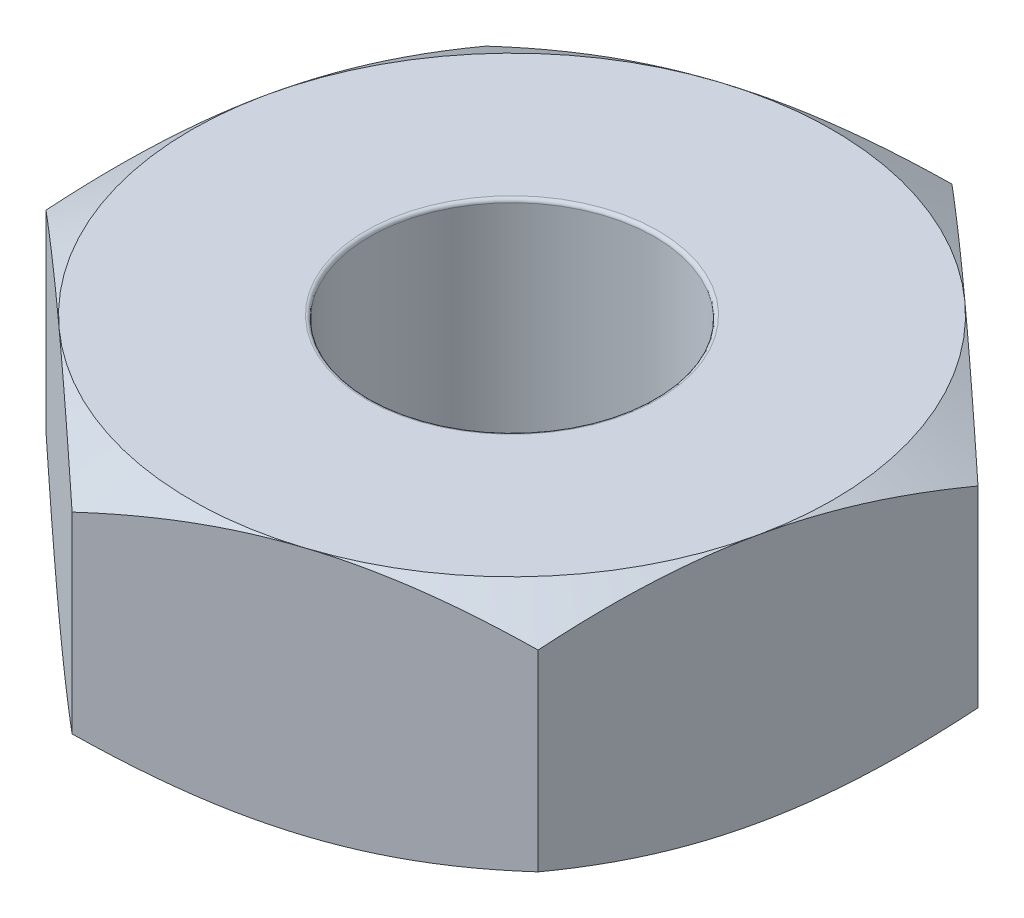
ISO-10303-21;
HEADER;
FILE_DESCRIPTION(('STEP AP214'),'2;1');
FILE_NAME('part.step','',(''),(''),'','','');
FILE_SCHEMA(('AUTOMOTIVE_DESIGN { 1 0 10303 214 1 1 1 1 }'));
ENDSEC;
DATA;
#1=APPLICATION_CONTEXT('core data for automotive mechanical design processes');
#2=APPLICATION_PROTOCOL_DEFINITION('international standard','automotive_design',2000,#1);
#3=PRODUCT_CONTEXT('',#1,'mechanical');
#4=PRODUCT('Part','Part','',(#3));
#5=PRODUCT_RELATED_PRODUCT_CATEGORY('part','',(#4));
#6=PRODUCT_DEFINITION_FORMATION('','',#4);
#7=PRODUCT_DEFINITION_CONTEXT('part definition',#1,'design');
#8=PRODUCT_DEFINITION('design','',#6,#7);
#9=PRODUCT_DEFINITION_SHAPE('','',#8);
#10=(LENGTH_UNIT() NAMED_UNIT(*) SI_UNIT(.MILLI.,.METRE.));
#11=(NAMED_UNIT(*) PLANE_ANGLE_UNIT() SI_UNIT($,.RADIAN.));
#12=(NAMED_UNIT(*) SI_UNIT($,.STERADIAN.) SOLID_ANGLE_UNIT());
#13=UNCERTAINTY_MEASURE_WITH_UNIT(LENGTH_MEASURE(1.E-05),#10,'distance_accuracy_value','');
#14=(GEOMETRIC_REPRESENTATION_CONTEXT(3) GLOBAL_UNCERTAINTY_ASSIGNED_CONTEXT((#13)) GLOBAL_UNIT_ASSIGNED_CONTEXT((#10,
#11,#12)) REPRESENTATION_CONTEXT('',''));
#15=CARTESIAN_POINT('',(0.,0.,0.));
#16=DIRECTION('',(0.,0.,1.));
#17=DIRECTION('',(1.,0.,0.));
#18=AXIS2_PLACEMENT_3D('',#15,#16,#17);
#19=CARTESIAN_POINT('',(-1.92635743648205,1.75,-1.74331495344654));
#20=DIRECTION('',(0.977620264712236,0.,0.210377322979396));
#21=DIRECTION('',(0.210377322979396,0.,-0.977620264712236));
#22=AXIS2_PLACEMENT_3D('',#19,#20,#21);
#23=PLANE('',#22);
#24=CARTESIAN_POINT('',(-2.47297679338139,0.201020954511134,0.796817000039254));
#25=CARTESIAN_POINT('',(-2.44895734804321,0.168048592161886,0.685198997788835));
#26=CARTESIAN_POINT('',(-2.42473056879824,0.138061213427717,0.572617517983087));
#27=CARTESIAN_POINT('',(-2.37585748062747,0.0857174441625529,0.345505010236752));
#28=CARTESIAN_POINT('',(-2.35121030316557,0.0633795717932209,0.230969946221932));
#29=CARTESIAN_POINT('',(-2.30222141016906,0.0286067366172094,0.00331929518716911));
#30=CARTESIAN_POINT('',(-2.27788723304971,0.0159403537807386,-0.10976126093009));
#31=CARTESIAN_POINT('',(-2.22910435283509,0.000818142280679829,-0.336454573657108));
#32=CARTESIAN_POINT('',(-2.20465582710381,-0.00165020762631375,-0.450066506059079));
#33=CARTESIAN_POINT('',(-2.15897070683305,0.00347929853350531,-0.662364574786212));
#34=CARTESIAN_POINT('',(-2.13772728038435,0.00981768518217696,-0.761082458891083));
#35=CARTESIAN_POINT('',(-2.09537883112932,0.029908364942905,-0.95787506745048));
#36=CARTESIAN_POINT('',(-2.07427395484554,0.0436675239374649,-1.05594911101689));
#37=CARTESIAN_POINT('',(-2.03183816040932,0.0780650315200796,-1.25314761132329));
#38=CARTESIAN_POINT('',(-2.01051261437593,0.0988492193352137,-1.35224710390662));
#39=CARTESIAN_POINT('',(-1.96817962483465,0.146021411298272,-1.54896787140807));
#40=CARTESIAN_POINT('',(-1.94717163879493,0.172398328472376,-1.64659166746347));
#41=CARTESIAN_POINT('',(-1.92631439782367,0.201020954511134,-1.74351495344654));
#42=B_SPLINE_CURVE_WITH_KNOTS('',3,(#24,#25,#26,#27,#28,#29,#30,#31,#32,#33,#34,#35,#36,#37,#38,
#39,#40,#41),.UNSPECIFIED.,.F.,.F.,(4,2,2,2,2,2,2,2,4),(0.,0.356657020868803,0.714171443494863,
1.06283712564932,1.41107458525488,1.71431537413071,2.01783721142022,2.32809250197451,
2.6377384016008),.UNSPECIFIED.);
#43=CARTESIAN_POINT('',(-2.47293375472301,0.20096189432334,0.796617000039254));
#44=VERTEX_POINT('',#43);
#45=CARTESIAN_POINT('',(-2.19964559560253,0.,-0.473348976703641));
#46=VERTEX_POINT('',#45);
#47=EDGE_CURVE('E382',#44,#46,#42,.T.);
#48=ORIENTED_EDGE('',*,*,#47,.F.);
#49=DIRECTION('',(0.,-1.,0.));
#50=VECTOR('',#49,1.);
#51=CARTESIAN_POINT('',(-2.47293375472301,1.75,0.796617000039254));
#52=LINE('',#51,#50);
#53=CARTESIAN_POINT('',(-2.47293375472301,1.54903810567666,0.796617000039254));
#54=VERTEX_POINT('',#53);
#55=EDGE_CURVE('E326',#54,#44,#52,.T.);
#56=ORIENTED_EDGE('',*,*,#55,.F.);
#57=CARTESIAN_POINT('',(-1.92631439782367,1.54897904548887,-1.74351495344654));
#58=CARTESIAN_POINT('',(-1.95033384316185,1.58195140783811,-1.63189695119612));
#59=CARTESIAN_POINT('',(-1.97456062240682,1.61193878657228,-1.51931547139037));
#60=CARTESIAN_POINT('',(-2.02343371057759,1.66428255583745,-1.29220296364404));
#61=CARTESIAN_POINT('',(-2.04808088803949,1.68662042820678,-1.17766789962922));
#62=CARTESIAN_POINT('',(-2.097069781036,1.72139326338279,-0.950017248594452));
#63=CARTESIAN_POINT('',(-2.12140395815535,1.73405964621926,-0.836936692477193));
#64=CARTESIAN_POINT('',(-2.17018683836997,1.74918185771932,-0.610243379750175));
#65=CARTESIAN_POINT('',(-2.19463536410125,1.75165020762631,-0.496631447348204));
#66=CARTESIAN_POINT('',(-2.24032048437201,1.74652070146649,-0.284333378621071));
#67=CARTESIAN_POINT('',(-2.26156391082071,1.74018231481782,-0.1856154945162));
#68=CARTESIAN_POINT('',(-2.30391236007574,1.72009163505709,0.0111771140431969));
#69=CARTESIAN_POINT('',(-2.32501723635952,1.70633247606254,0.109251157609604));
#70=CARTESIAN_POINT('',(-2.36745303079574,1.67193496847992,0.306449657916003));
#71=CARTESIAN_POINT('',(-2.38877857682914,1.65115078066479,0.405549150499341));
#72=CARTESIAN_POINT('',(-2.43111156637042,1.60397858870173,0.602269918000792));
#73=CARTESIAN_POINT('',(-2.45211955241014,1.57760167152762,0.69989371405619));
#74=CARTESIAN_POINT('',(-2.47297679338139,1.54897904548887,0.796817000039254));
#75=B_SPLINE_CURVE_WITH_KNOTS('',3,(#57,#58,#59,#60,#61,#62,#63,#64,#65,#66,#67,#68,#69,#70,#71,
#72,#73,#74),.UNSPECIFIED.,.F.,.F.,(4,2,2,2,2,2,2,2,4),(0.,0.356657020868802,0.714171443494864,
1.06283712564932,1.41107458525488,1.71431537413071,2.01783721142022,2.32809250197451,
2.6377384016008),.UNSPECIFIED.);
#76=CARTESIAN_POINT('',(-2.19964559560253,1.75,-0.473348976703641));
#77=VERTEX_POINT('',#76);
#78=EDGE_CURVE('E265',#77,#54,#75,.T.);
#79=ORIENTED_EDGE('',*,*,#78,.F.);
#80=CARTESIAN_POINT('',(-1.92635743648205,1.54903810567666,-1.74331495344654));
#81=VERTEX_POINT('',#80);
#82=EDGE_CURVE('E339',#81,#77,#75,.T.);
#83=ORIENTED_EDGE('',*,*,#82,.F.);
#84=DIRECTION('',(0.,-1.,0.));
#85=VECTOR('',#84,1.);
#86=CARTESIAN_POINT('',(-1.92635743648205,1.75,-1.74331495344654));
#87=LINE('',#86,#85);
#88=CARTESIAN_POINT('',(-1.92635743648205,0.200961894323341,-1.74331495344654));
#89=VERTEX_POINT('',#88);
#90=EDGE_CURVE('E337',#81,#89,#87,.T.);
#91=ORIENTED_EDGE('',*,*,#90,.T.);
#92=EDGE_CURVE('E219',#46,#89,#42,.T.);
#93=ORIENTED_EDGE('',*,*,#92,.F.);
#94=EDGE_LOOP('',(#48,#56,#79,#83,#91,#93));
#95=FACE_BOUND('',#94,.T.);
#96=ADVANCED_FACE('F44',(#95),#23,.F.);
#97=CARTESIAN_POINT('',(-2.47293375472301,1.75,0.796617000039254));
#98=DIRECTION('',(0.671002238436439,0.,-0.741455323005566));
#99=DIRECTION('',(-0.741455323005566,0.,-0.671002238436439));
#100=AXIS2_PLACEMENT_3D('',#97,#98,#99);
#101=PLANE('',#100);
#102=CARTESIAN_POINT('',(-0.546376318240962,0.20103976755529,2.54011294948585));
#103=CARTESIAN_POINT('',(-0.631031436480556,0.168065860229414,2.46350176055594));
#104=CARTESIAN_POINT('',(-0.716417289037993,0.138076840461838,2.38622927168284));
#105=CARTESIAN_POINT('',(-0.888667668183759,0.0857296652320174,2.23034612351174));
#106=CARTESIAN_POINT('',(-0.975535256369834,0.0633900300729835,2.15173269352899));
#107=CARTESIAN_POINT('',(-1.14819382489491,0.0286137099836664,1.99548014213327));
#108=CARTESIAN_POINT('',(-1.23395823319763,0.0159455943918624,1.91786506788169));
#109=CARTESIAN_POINT('',(-1.4058907858504,0.000820033774548395,1.76226954633031));
#110=CARTESIAN_POINT('',(-1.4920583048965,-0.00164993391176888,1.68428966491808));
#111=CARTESIAN_POINT('',(-1.65307943130273,0.00347701495143028,1.53856876589456));
#112=CARTESIAN_POINT('',(-1.72795709194408,0.00981508819538363,1.47080598054485));
#113=CARTESIAN_POINT('',(-1.87722456486624,0.029906615516067,1.33572190285489));
#114=CARTESIAN_POINT('',(-1.95161386051285,0.043666938844768,1.26840107805826));
#115=CARTESIAN_POINT('',(-2.10118931899156,0.0780680813477293,1.13303827959924));
#116=CARTESIAN_POINT('',(-2.17635654196191,0.0988547865350832,1.06501344613294));
#117=CARTESIAN_POINT('',(-2.325569616737,0.146032969812356,0.92997859767813));
#118=CARTESIAN_POINT('',(-2.39961738152065,0.172413356174257,0.862966851481967));
#119=CARTESIAN_POINT('',(-2.47313375472301,0.20103976755529,0.796436004039193));
#120=B_SPLINE_CURVE_WITH_KNOTS('',3,(#102,#103,#104,#105,#106,#107,#108,#109,#110,#111,#112,
#113,#114,#115,#116,#117,#118,#119),.UNSPECIFIED.,.F.,.F.,(4,2,2,2,2,2,2,2,4),(0.,
0.356661482916368,0.714180489782925,1.06285020765253,1.41109165427473,1.71436127910143,
2.01791206110378,2.32819782836683,2.63787398847501),.UNSPECIFIED.);
#121=CARTESIAN_POINT('',(-0.546576318240962,0.200961894323341,2.53993195348579));
#122=VERTEX_POINT('',#121);
#123=CARTESIAN_POINT('',(-1.50975503648199,0.,1.66827447676252));
#124=VERTEX_POINT('',#123);
#125=EDGE_CURVE('E154',#122,#124,#120,.T.);
#126=ORIENTED_EDGE('',*,*,#125,.F.);
#127=DIRECTION('',(0.,-1.,0.));
#128=VECTOR('',#127,1.);
#129=CARTESIAN_POINT('',(-0.546576318240962,1.75,2.53993195348579));
#130=LINE('',#129,#128);
#131=CARTESIAN_POINT('',(-0.546576318240962,1.54903810567666,2.53993195348579));
#132=VERTEX_POINT('',#131);
#133=EDGE_CURVE('E170',#132,#122,#130,.T.);
#134=ORIENTED_EDGE('',*,*,#133,.F.);
#135=CARTESIAN_POINT('',(-2.47313375472301,1.54896023244471,0.796436004039193));
#136=CARTESIAN_POINT('',(-2.38847863648342,1.58193413977059,0.873047192969107));
#137=CARTESIAN_POINT('',(-2.30309278392598,1.61192315953816,0.950319681842201));
#138=CARTESIAN_POINT('',(-2.13084240478021,1.66427033476798,1.10620283001331));
#139=CARTESIAN_POINT('',(-2.04397481659414,1.68660996992702,1.18481625999605));
#140=CARTESIAN_POINT('',(-1.87131624806906,1.72138629001633,1.34106881139178));
#141=CARTESIAN_POINT('',(-1.78555183976634,1.73405440560814,1.41868388564335));
#142=CARTESIAN_POINT('',(-1.61361928711357,1.74917996622545,1.57427940719473));
#143=CARTESIAN_POINT('',(-1.52745176806748,1.75164993391177,1.65225928860697));
#144=CARTESIAN_POINT('',(-1.36643064166124,1.74652298504857,1.79798018763048));
#145=CARTESIAN_POINT('',(-1.29155298101989,1.74018491180462,1.8657429729802));
#146=CARTESIAN_POINT('',(-1.14228550809774,1.72009338448393,2.00082705067015));
#147=CARTESIAN_POINT('',(-1.06789621245112,1.70633306115523,2.06814787546679));
#148=CARTESIAN_POINT('',(-0.918320753972418,1.67193191865227,2.2035106739258));
#149=CARTESIAN_POINT('',(-0.843153531002059,1.65114521346492,2.27153550739211));
#150=CARTESIAN_POINT('',(-0.693940456226975,1.60396703018764,2.40657035584692));
#151=CARTESIAN_POINT('',(-0.619892691443327,1.57758664382574,2.47358210204308));
#152=CARTESIAN_POINT('',(-0.546376318240962,1.54896023244471,2.54011294948585));
#153=B_SPLINE_CURVE_WITH_KNOTS('',3,(#135,#136,#137,#138,#139,#140,#141,#142,#143,#144,#145,
#146,#147,#148,#149,#150,#151,#152),.UNSPECIFIED.,.F.,.F.,(4,2,2,2,2,2,2,2,4),(0.,
0.356661482916368,0.714180489782924,1.06285020765253,1.41109165427473,1.71436127910143,
2.01791206110379,2.32819782836683,2.63787398847502),.UNSPECIFIED.);
#154=CARTESIAN_POINT('',(-1.50975503648199,1.75,1.66827447676252));
#155=VERTEX_POINT('',#154);
#156=EDGE_CURVE('E258',#155,#132,#153,.T.);
#157=ORIENTED_EDGE('',*,*,#156,.F.);
#158=EDGE_CURVE('E264',#54,#155,#153,.T.);
#159=ORIENTED_EDGE('',*,*,#158,.F.);
#160=ORIENTED_EDGE('',*,*,#55,.T.);
#161=EDGE_CURVE('E180',#124,#44,#120,.T.);
#162=ORIENTED_EDGE('',*,*,#161,.F.);
#163=EDGE_LOOP('',(#126,#134,#157,#159,#160,#162));
#164=FACE_BOUND('',#163,.T.);
#165=ADVANCED_FACE('F271',(#164),#101,.F.);
#166=CARTESIAN_POINT('',(-0.546576318240962,1.75,2.53993195348579));
#167=DIRECTION('',(-0.306618026275797,0.,-0.951832645984962));
#168=DIRECTION('',(-0.951832645984962,0.,0.306618026275797));
#169=AXIS2_PLACEMENT_3D('',#166,#167,#168);
#170=PLANE('',#169);
#171=CARTESIAN_POINT('',(1.92655743648205,0.201022554702071,1.74325052656907));
#172=CARTESIAN_POINT('',(1.81788359930556,0.16805006093831,1.77825810652908));
#173=CARTESIAN_POINT('',(1.70827169856531,0.138062542619069,1.81356786902051));
#174=CARTESIAN_POINT('',(1.48714976522591,0.0857184836453841,1.88479884754684));
#175=CARTESIAN_POINT('',(1.37563580295879,0.0633804613347637,1.92072132946293));
#176=CARTESIAN_POINT('',(1.15398991642083,0.0286073297355813,1.99212109133188));
#177=CARTESIAN_POINT('',(1.04389209940151,0.0159407995128798,2.02758738416617));
#178=CARTESIAN_POINT('',(0.823178292321266,0.000818303141337024,2.09868689119004));
#179=CARTESIAN_POINT('',(0.712563104749169,-0.00165018437146979,2.13431984687038));
#180=CARTESIAN_POINT('',(0.505864132264773,0.00347910427781182,2.20090469373789));
#181=CARTESIAN_POINT('',(0.409749439760693,0.00981746427553705,2.23186654132319));
#182=CARTESIAN_POINT('',(0.218146255457854,0.0299082161369458,2.29358851571324));
#183=CARTESIAN_POINT('',(0.122658426611789,0.0436674741696915,2.32434842895812));
#184=CARTESIAN_POINT('',(-0.0693399587407154,0.078065290932677,2.38619771119618));
#185=CARTESIAN_POINT('',(-0.165826208902949,0.0988496928691683,2.41727925028006));
#186=CARTESIAN_POINT('',(-0.357359456794581,0.146022394437704,2.47897869574713));
#187=CARTESIAN_POINT('',(-0.452408909254458,0.172399606691596,2.50959739288342));
#188=CARTESIAN_POINT('',(-0.546776318240962,0.201022554702071,2.53999638036326));
#189=B_SPLINE_CURVE_WITH_KNOTS('',3,(#171,#172,#173,#174,#175,#176,#177,#178,#179,#180,#181,
#182,#183,#184,#185,#186,#187,#188),.UNSPECIFIED.,.F.,.F.,(4,2,2,2,2,2,2,2,4),(0.,
0.356657400399917,0.714172212950532,1.06283823837281,1.41107603710408,1.71431927874305,
2.01784357804594,2.32810146091608,2.63774993446802),.UNSPECIFIED.);
#190=CARTESIAN_POINT('',(1.92635743648205,0.20096189432334,1.74331495344654));
#191=VERTEX_POINT('',#190);
#192=CARTESIAN_POINT('',(0.689890559120544,0.,2.14162345346616));
#193=VERTEX_POINT('',#192);
#194=EDGE_CURVE('E133',#191,#193,#189,.T.);
#195=ORIENTED_EDGE('',*,*,#194,.F.);
#196=DIRECTION('',(0.,-1.,0.));
#197=VECTOR('',#196,1.);
#198=CARTESIAN_POINT('',(1.92635743648205,1.75,1.74331495344654));
#199=LINE('',#198,#197);
#200=CARTESIAN_POINT('',(1.92635743648205,1.54903810567666,1.74331495344654));
#201=VERTEX_POINT('',#200);
#202=EDGE_CURVE('E330',#201,#191,#199,.T.);
#203=ORIENTED_EDGE('',*,*,#202,.F.);
#204=CARTESIAN_POINT('',(-0.546776318240962,1.54897744529793,2.53999638036326));
#205=CARTESIAN_POINT('',(-0.43810248106447,1.58194993906169,2.50498880040324));
#206=CARTESIAN_POINT('',(-0.328490580324218,1.61193745738093,2.46967903791182));
#207=CARTESIAN_POINT('',(-0.107368646984819,1.66428151635462,2.39844805938549));
#208=CARTESIAN_POINT('',(0.00414531528229828,1.68661953866524,2.3625255774694));
#209=CARTESIAN_POINT('',(0.225791201820258,1.72139267026442,2.29112581560045));
#210=CARTESIAN_POINT('',(0.335889018839577,1.73405920048712,2.25565952276616));
#211=CARTESIAN_POINT('',(0.556602825919822,1.74918169685866,2.18456001574229));
#212=CARTESIAN_POINT('',(0.667218013491919,1.75165018437147,2.14892706006195));
#213=CARTESIAN_POINT('',(0.873916985976315,1.74652089572219,2.08234221319444));
#214=CARTESIAN_POINT('',(0.970031678480394,1.74018253572446,2.05138036560913));
#215=CARTESIAN_POINT('',(1.16163486278323,1.72009178386305,1.98965839121909));
#216=CARTESIAN_POINT('',(1.2571226916293,1.70633252583031,1.95889847797421));
#217=CARTESIAN_POINT('',(1.4491210769818,1.67193470906732,1.89704919573615));
#218=CARTESIAN_POINT('',(1.54560732714404,1.65115030713083,1.86596765665226));
#219=CARTESIAN_POINT('',(1.73714057503567,1.6039776055623,1.8042682111852));
#220=CARTESIAN_POINT('',(1.83219002749555,1.5776003933084,1.77364951404891));
#221=CARTESIAN_POINT('',(1.92655743648205,1.54897744529793,1.74325052656907));
#222=B_SPLINE_CURVE_WITH_KNOTS('',3,(#204,#205,#206,#207,#208,#209,#210,#211,#212,#213,#214,
#215,#216,#217,#218,#219,#220,#221),.UNSPECIFIED.,.F.,.F.,(4,2,2,2,2,2,2,2,4),(0.,
0.356657400399917,0.714172212950531,1.06283823837281,1.41107603710408,1.71431927874306,
2.01784357804594,2.32810146091608,2.63774993446802),.UNSPECIFIED.);
#223=CARTESIAN_POINT('',(0.689890559120543,1.75,2.14162345346616));
#224=VERTEX_POINT('',#223);
#225=EDGE_CURVE('E251',#224,#201,#222,.T.);
#226=ORIENTED_EDGE('',*,*,#225,.F.);
#227=EDGE_CURVE('E257',#132,#224,#222,.T.);
#228=ORIENTED_EDGE('',*,*,#227,.F.);
#229=ORIENTED_EDGE('',*,*,#133,.T.);
#230=EDGE_CURVE('E146',#193,#122,#189,.T.);
#231=ORIENTED_EDGE('',*,*,#230,.F.);
#232=EDGE_LOOP('',(#195,#203,#226,#228,#229,#231));
#233=FACE_BOUND('',#232,.T.);
#234=ADVANCED_FACE('F167',(#233),#170,.F.);
#235=CARTESIAN_POINT('',(1.92635743648205,1.75,1.74331495344654));
#236=DIRECTION('',(-0.977620264712236,0.,-0.210377322979396));
#237=DIRECTION('',(-0.210377322979396,0.,0.977620264712236));
#238=AXIS2_PLACEMENT_3D('',#235,#236,#237);
#239=PLANE('',#238);
#240=CARTESIAN_POINT('',(2.47297679338139,0.201020954511134,-0.796817000039255));
#241=CARTESIAN_POINT('',(2.44895734804321,0.168048592161886,-0.685198997788837));
#242=CARTESIAN_POINT('',(2.42473056879824,0.138061213427717,-0.572617517983089));
#243=CARTESIAN_POINT('',(2.37585748062747,0.0857174441625529,-0.345505010236754));
#244=CARTESIAN_POINT('',(2.35121030316557,0.0633795717932208,-0.230969946221934));
#245=CARTESIAN_POINT('',(2.30222141016906,0.0286067366172093,-0.00331929518717069));
#246=CARTESIAN_POINT('',(2.27788723304971,0.0159403537807386,0.109761260930089));
#247=CARTESIAN_POINT('',(2.22910435283509,0.000818142280679664,0.336454573657107));
#248=CARTESIAN_POINT('',(2.20465582710381,-0.00165020762631409,0.450066506059077));
#249=CARTESIAN_POINT('',(2.15897070683305,0.00347929853350479,0.662364574786211));
#250=CARTESIAN_POINT('',(2.13772728038435,0.00981768518217645,0.761082458891082));
#251=CARTESIAN_POINT('',(2.09537883112932,0.0299083649429045,0.957875067450479));
#252=CARTESIAN_POINT('',(2.07427395484554,0.0436675239374645,1.05594911101689));
#253=CARTESIAN_POINT('',(2.03183816040932,0.0780650315200793,1.25314761132329));
#254=CARTESIAN_POINT('',(2.01051261437593,0.0988492193352135,1.35224710390662));
#255=CARTESIAN_POINT('',(1.96817962483464,0.146021411298272,1.54896787140807));
#256=CARTESIAN_POINT('',(1.94717163879493,0.172398328472376,1.64659166746347));
#257=CARTESIAN_POINT('',(1.92631439782367,0.201020954511134,1.74351495344654));
#258=B_SPLINE_CURVE_WITH_KNOTS('',3,(#240,#241,#242,#243,#244,#245,#246,#247,#248,#249,#250,
#251,#252,#253,#254,#255,#256,#257),.UNSPECIFIED.,.F.,.F.,(4,2,2,2,2,2,2,2,4),(0.,
0.356657020868802,0.714171443494863,1.06283712564932,1.41107458525488,1.71431537413071,
2.01783721142022,2.32809250197451,2.6377384016008),.UNSPECIFIED.);
#259=CARTESIAN_POINT('',(2.47293375472301,0.20096189432334,-0.796617000039255));
#260=VERTEX_POINT('',#259);
#261=CARTESIAN_POINT('',(2.19964559560253,0.,0.473348976703641));
#262=VERTEX_POINT('',#261);
#263=EDGE_CURVE('E59',#260,#262,#258,.T.);
#264=ORIENTED_EDGE('',*,*,#263,.F.);
#265=DIRECTION('',(0.,-1.,0.));
#266=VECTOR('',#265,1.);
#267=CARTESIAN_POINT('',(2.47293375472301,1.75,-0.796617000039255));
#268=LINE('',#267,#266);
#269=CARTESIAN_POINT('',(2.47293375472301,1.54903810567666,-0.796617000039255));
#270=VERTEX_POINT('',#269);
#271=EDGE_CURVE('E332',#270,#260,#268,.T.);
#272=ORIENTED_EDGE('',*,*,#271,.F.);
#273=CARTESIAN_POINT('',(1.92631439782367,1.54897904548887,1.74351495344654));
#274=CARTESIAN_POINT('',(1.95033384316185,1.58195140783811,1.63189695119612));
#275=CARTESIAN_POINT('',(1.97456062240682,1.61193878657228,1.51931547139037));
#276=CARTESIAN_POINT('',(2.02343371057759,1.66428255583745,1.29220296364404));
#277=CARTESIAN_POINT('',(2.04808088803949,1.68662042820678,1.17766789962922));
#278=CARTESIAN_POINT('',(2.097069781036,1.72139326338279,0.950017248594452));
#279=CARTESIAN_POINT('',(2.12140395815535,1.73405964621926,0.836936692477193));
#280=CARTESIAN_POINT('',(2.17018683836997,1.74918185771932,0.610243379750175));
#281=CARTESIAN_POINT('',(2.19463536410125,1.75165020762631,0.496631447348204));
#282=CARTESIAN_POINT('',(2.24032048437201,1.7465207014665,0.284333378621071));
#283=CARTESIAN_POINT('',(2.26156391082071,1.74018231481782,0.1856154945162));
#284=CARTESIAN_POINT('',(2.30391236007574,1.7200916350571,-0.0111771140431972));
#285=CARTESIAN_POINT('',(2.32501723635952,1.70633247606254,-0.109251157609604));
#286=CARTESIAN_POINT('',(2.36745303079574,1.67193496847992,-0.306449657916003));
#287=CARTESIAN_POINT('',(2.38877857682914,1.65115078066479,-0.405549150499341));
#288=CARTESIAN_POINT('',(2.43111156637042,1.60397858870173,-0.602269918000792));
#289=CARTESIAN_POINT('',(2.45211955241014,1.57760167152762,-0.69989371405619));
#290=CARTESIAN_POINT('',(2.47297679338139,1.54897904548887,-0.796817000039255));
#291=B_SPLINE_CURVE_WITH_KNOTS('',3,(#273,#274,#275,#276,#277,#278,#279,#280,#281,#282,#283,
#284,#285,#286,#287,#288,#289,#290),.UNSPECIFIED.,.F.,.F.,(4,2,2,2,2,2,2,2,4),(0.,
0.356657020868803,0.714171443494864,1.06283712564932,1.41107458525488,1.71431537413071,
2.01783721142022,2.32809250197451,2.6377384016008),.UNSPECIFIED.);
#292=CARTESIAN_POINT('',(2.19964559560253,1.75,0.473348976703641));
#293=VERTEX_POINT('',#292);
#294=EDGE_CURVE('E238',#293,#270,#291,.T.);
#295=ORIENTED_EDGE('',*,*,#294,.F.);
#296=EDGE_CURVE('E244',#201,#293,#291,.T.);
#297=ORIENTED_EDGE('',*,*,#296,.F.);
#298=ORIENTED_EDGE('',*,*,#202,.T.);
#299=EDGE_CURVE('E140',#262,#191,#258,.T.);
#300=ORIENTED_EDGE('',*,*,#299,.F.);
#301=EDGE_LOOP('',(#264,#272,#295,#297,#298,#300));
#302=FACE_BOUND('',#301,.T.);
#303=ADVANCED_FACE('F230',(#302),#239,.F.);
#304=CARTESIAN_POINT('',(2.47293375472301,1.75,-0.796617000039255));
#305=DIRECTION('',(-0.671002238436439,0.,0.741455323005566));
#306=DIRECTION('',(0.741455323005566,0.,0.671002238436439));
#307=AXIS2_PLACEMENT_3D('',#304,#305,#306);
#308=PLANE('',#307);
#309=CARTESIAN_POINT('',(0.546376318240962,0.20103976755529,-2.54011294948585));
#310=CARTESIAN_POINT('',(0.631031436480557,0.168065860229415,-2.46350176055594));
#311=CARTESIAN_POINT('',(0.716417289037993,0.138076840461838,-2.38622927168284));
#312=CARTESIAN_POINT('',(0.88866766818376,0.0857296652320175,-2.23034612351174));
#313=CARTESIAN_POINT('',(0.975535256369835,0.0633900300729834,-2.15173269352899));
#314=CARTESIAN_POINT('',(1.14819382489491,0.0286137099836664,-1.99548014213327));
#315=CARTESIAN_POINT('',(1.23395823319763,0.0159455943918626,-1.91786506788169));
#316=CARTESIAN_POINT('',(1.4058907858504,0.00082003377454881,-1.76226954633031));
#317=CARTESIAN_POINT('',(1.4920583048965,-0.0016499339117685,-1.68428966491808));
#318=CARTESIAN_POINT('',(1.65307943130273,0.00347701495143065,-1.53856876589456));
#319=CARTESIAN_POINT('',(1.72795709194408,0.00981508819538402,-1.47080598054485));
#320=CARTESIAN_POINT('',(1.87722456486624,0.0299066155160675,-1.33572190285489));
#321=CARTESIAN_POINT('',(1.95161386051285,0.0436669388447686,-1.26840107805826));
#322=CARTESIAN_POINT('',(2.10118931899156,0.0780680813477299,-1.13303827959924));
#323=CARTESIAN_POINT('',(2.17635654196192,0.0988547865350838,-1.06501344613294));
#324=CARTESIAN_POINT('',(2.325569616737,0.146032969812356,-0.929978597678131));
#325=CARTESIAN_POINT('',(2.39961738152065,0.172413356174257,-0.862966851481968));
#326=CARTESIAN_POINT('',(2.47313375472301,0.20103976755529,-0.796436004039195));
#327=B_SPLINE_CURVE_WITH_KNOTS('',3,(#309,#310,#311,#312,#313,#314,#315,#316,#317,#318,#319,
#320,#321,#322,#323,#324,#325,#326),.UNSPECIFIED.,.F.,.F.,(4,2,2,2,2,2,2,2,4),(0.,
0.356661482916368,0.714180489782925,1.06285020765253,1.41109165427473,1.71436127910143,
2.01791206110378,2.32819782836683,2.63787398847501),.UNSPECIFIED.);
#328=CARTESIAN_POINT('',(0.546576318240962,0.200961894323341,-2.53993195348579));
#329=VERTEX_POINT('',#328);
#330=CARTESIAN_POINT('',(1.50975503648199,0.,-1.66827447676252));
#331=VERTEX_POINT('',#330);
#332=EDGE_CURVE('E67',#329,#331,#327,.T.);
#333=ORIENTED_EDGE('',*,*,#332,.F.);
#334=DIRECTION('',(0.,-1.,0.));
#335=VECTOR('',#334,1.);
#336=CARTESIAN_POINT('',(0.546576318240962,1.75,-2.53993195348579));
#337=LINE('',#336,#335);
#338=CARTESIAN_POINT('',(0.546576318240962,1.54903810567666,-2.53993195348579));
#339=VERTEX_POINT('',#338);
#340=EDGE_CURVE('E335',#339,#329,#337,.T.);
#341=ORIENTED_EDGE('',*,*,#340,.F.);
#342=CARTESIAN_POINT('',(2.47313375472301,1.54896023244471,-0.796436004039195));
#343=CARTESIAN_POINT('',(2.38847863648342,1.58193413977059,-0.873047192969108));
#344=CARTESIAN_POINT('',(2.30309278392598,1.61192315953816,-0.950319681842202));
#345=CARTESIAN_POINT('',(2.13084240478021,1.66427033476798,-1.10620283001331));
#346=CARTESIAN_POINT('',(2.04397481659414,1.68660996992702,-1.18481625999606));
#347=CARTESIAN_POINT('',(1.87131624806906,1.72138629001633,-1.34106881139178));
#348=CARTESIAN_POINT('',(1.78555183976634,1.73405440560814,-1.41868388564335));
#349=CARTESIAN_POINT('',(1.61361928711357,1.74917996622545,-1.57427940719473));
#350=CARTESIAN_POINT('',(1.52745176806747,1.75164993391177,-1.65225928860697));
#351=CARTESIAN_POINT('',(1.36643064166124,1.74652298504857,-1.79798018763048));
#352=CARTESIAN_POINT('',(1.29155298101989,1.74018491180462,-1.8657429729802));
#353=CARTESIAN_POINT('',(1.14228550809774,1.72009338448393,-2.00082705067015));
#354=CARTESIAN_POINT('',(1.06789621245112,1.70633306115523,-2.06814787546679));
#355=CARTESIAN_POINT('',(0.918320753972418,1.67193191865227,-2.2035106739258));
#356=CARTESIAN_POINT('',(0.843153531002059,1.65114521346492,-2.27153550739211));
#357=CARTESIAN_POINT('',(0.693940456226975,1.60396703018764,-2.40657035584692));
#358=CARTESIAN_POINT('',(0.619892691443327,1.57758664382574,-2.47358210204308));
#359=CARTESIAN_POINT('',(0.546376318240962,1.54896023244471,-2.54011294948585));
#360=B_SPLINE_CURVE_WITH_KNOTS('',3,(#342,#343,#344,#345,#346,#347,#348,#349,#350,#351,#352,
#353,#354,#355,#356,#357,#358,#359),.UNSPECIFIED.,.F.,.F.,(4,2,2,2,2,2,2,2,4),(0.,
0.356661482916368,0.714180489782925,1.06285020765253,1.41109165427473,1.71436127910143,
2.01791206110378,2.32819782836683,2.63787398847501),.UNSPECIFIED.);
#361=CARTESIAN_POINT('',(1.50975503648199,1.75,-1.66827447676252));
#362=VERTEX_POINT('',#361);
#363=EDGE_CURVE('E246',#362,#339,#360,.T.);
#364=ORIENTED_EDGE('',*,*,#363,.F.);
#365=EDGE_CURVE('E245',#270,#362,#360,.T.);
#366=ORIENTED_EDGE('',*,*,#365,.F.);
#367=ORIENTED_EDGE('',*,*,#271,.T.);
#368=EDGE_CURVE('E229',#331,#260,#327,.T.);
#369=ORIENTED_EDGE('',*,*,#368,.F.);
#370=EDGE_LOOP('',(#333,#341,#364,#366,#367,#369));
#371=FACE_BOUND('',#370,.T.);
#372=ADVANCED_FACE('F233',(#371),#308,.F.);
#373=CARTESIAN_POINT('',(0.546576318240962,1.75,-2.53993195348579));
#374=DIRECTION('',(0.306618026275797,0.,0.951832645984962));
#375=DIRECTION('',(0.951832645984962,0.,-0.306618026275797));
#376=AXIS2_PLACEMENT_3D('',#373,#374,#375);
#377=PLANE('',#376);
#378=CARTESIAN_POINT('',(-1.92655743648205,0.201022554702071,-1.74325052656907));
#379=CARTESIAN_POINT('',(-1.81788359930556,0.16805006093831,-1.77825810652908));
#380=CARTESIAN_POINT('',(-1.70827169856531,0.138062542619069,-1.81356786902051));
#381=CARTESIAN_POINT('',(-1.48714976522591,0.0857184836453841,-1.88479884754684));
#382=CARTESIAN_POINT('',(-1.37563580295879,0.0633804613347638,-1.92072132946293));
#383=CARTESIAN_POINT('',(-1.15398991642083,0.0286073297355813,-1.99212109133188));
#384=CARTESIAN_POINT('',(-1.04389209940151,0.0159407995128796,-2.02758738416617));
#385=CARTESIAN_POINT('',(-0.823178292321266,0.000818303141336771,-2.09868689119004));
#386=CARTESIAN_POINT('',(-0.712563104749169,-0.00165018437147,-2.13431984687038));
#387=CARTESIAN_POINT('',(-0.505864132264773,0.0034791042778117,-2.20090469373789));
#388=CARTESIAN_POINT('',(-0.409749439760693,0.00981746427553697,-2.23186654132319));
#389=CARTESIAN_POINT('',(-0.218146255457855,0.0299082161369458,-2.29358851571324));
#390=CARTESIAN_POINT('',(-0.12265842661179,0.0436674741696915,-2.32434842895812));
#391=CARTESIAN_POINT('',(0.0693399587407153,0.0780652909326769,-2.38619771119618));
#392=CARTESIAN_POINT('',(0.165826208902949,0.0988496928691683,-2.41727925028006));
#393=CARTESIAN_POINT('',(0.357359456794581,0.146022394437704,-2.47897869574713));
#394=CARTESIAN_POINT('',(0.452408909254458,0.172399606691595,-2.50959739288342));
#395=CARTESIAN_POINT('',(0.546776318240962,0.201022554702071,-2.53999638036326));
#396=B_SPLINE_CURVE_WITH_KNOTS('',3,(#378,#379,#380,#381,#382,#383,#384,#385,#386,#387,#388,
#389,#390,#391,#392,#393,#394,#395),.UNSPECIFIED.,.F.,.F.,(4,2,2,2,2,2,2,2,4),(0.,
0.356657400399917,0.714172212950532,1.06283823837281,1.41107603710408,1.71431927874306,
2.01784357804594,2.32810146091608,2.63774993446802),.UNSPECIFIED.);
#397=CARTESIAN_POINT('',(-0.689890559120544,0.,-2.14162345346616));
#398=VERTEX_POINT('',#397);
#399=EDGE_CURVE('E389',#89,#398,#396,.T.);
#400=ORIENTED_EDGE('',*,*,#399,.F.);
#401=ORIENTED_EDGE('',*,*,#90,.F.);
#402=CARTESIAN_POINT('',(0.546776318240962,1.54897744529793,-2.53999638036326));
#403=CARTESIAN_POINT('',(0.43810248106447,1.58194993906169,-2.50498880040324));
#404=CARTESIAN_POINT('',(0.328490580324218,1.61193745738093,-2.46967903791182));
#405=CARTESIAN_POINT('',(0.107368646984819,1.66428151635462,-2.39844805938549));
#406=CARTESIAN_POINT('',(-0.00414531528229816,1.68661953866524,-2.3625255774694));
#407=CARTESIAN_POINT('',(-0.225791201820258,1.72139267026442,-2.29112581560045));
#408=CARTESIAN_POINT('',(-0.335889018839577,1.73405920048712,-2.25565952276616));
#409=CARTESIAN_POINT('',(-0.556602825919822,1.74918169685866,-2.18456001574229));
#410=CARTESIAN_POINT('',(-0.667218013491919,1.75165018437147,-2.14892706006195));
#411=CARTESIAN_POINT('',(-0.873916985976314,1.74652089572219,-2.08234221319444));
#412=CARTESIAN_POINT('',(-0.970031678480394,1.74018253572446,-2.05138036560913));
#413=CARTESIAN_POINT('',(-1.16163486278323,1.72009178386305,-1.98965839121909));
#414=CARTESIAN_POINT('',(-1.2571226916293,1.70633252583031,-1.95889847797421));
#415=CARTESIAN_POINT('',(-1.4491210769818,1.67193470906732,-1.89704919573615));
#416=CARTESIAN_POINT('',(-1.54560732714404,1.65115030713083,-1.86596765665226));
#417=CARTESIAN_POINT('',(-1.73714057503567,1.6039776055623,-1.8042682111852));
#418=CARTESIAN_POINT('',(-1.83219002749555,1.5776003933084,-1.77364951404891));
#419=CARTESIAN_POINT('',(-1.92655743648205,1.54897744529793,-1.74325052656907));
#420=B_SPLINE_CURVE_WITH_KNOTS('',3,(#402,#403,#404,#405,#406,#407,#408,#409,#410,#411,#412,
#413,#414,#415,#416,#417,#418,#419),.UNSPECIFIED.,.F.,.F.,(4,2,2,2,2,2,2,2,4),(0.,
0.356657400399917,0.714172212950531,1.06283823837281,1.41107603710408,1.71431927874306,
2.01784357804594,2.32810146091608,2.63774993446802),.UNSPECIFIED.);
#421=CARTESIAN_POINT('',(-0.689890559120544,1.75,-2.14162345346616));
#422=VERTEX_POINT('',#421);
#423=EDGE_CURVE('E320',#422,#81,#420,.T.);
#424=ORIENTED_EDGE('',*,*,#423,.F.);
#425=EDGE_CURVE('E159',#339,#422,#420,.T.);
#426=ORIENTED_EDGE('',*,*,#425,.F.);
#427=ORIENTED_EDGE('',*,*,#340,.T.);
#428=EDGE_CURVE('E204',#398,#329,#396,.T.);
#429=ORIENTED_EDGE('',*,*,#428,.F.);
#430=EDGE_LOOP('',(#400,#401,#424,#426,#427,#429));
#431=FACE_BOUND('',#430,.T.);
#432=ADVANCED_FACE('F315',(#431),#377,.F.);
#433=CARTESIAN_POINT('',(0.,0.,0.));
#434=DIRECTION('',(0.,1.,0.));
#435=DIRECTION('',(0.,0.,1.));
#436=AXIS2_PLACEMENT_3D('',#433,#434,#435);
#437=PLANE('',#436);
#438=CARTESIAN_POINT('',(0.,0.,0.));
#439=DIRECTION('',(0.,1.,0.));
#440=DIRECTION('',(0.,0.,1.));
#441=AXIS2_PLACEMENT_3D('',#438,#439,#440);
#442=CIRCLE('',#441,1.025);
#443=CARTESIAN_POINT('',(0.,0.,1.025));
#444=VERTEX_POINT('',#443);
#445=EDGE_CURVE('E164',#444,#444,#442,.T.);
#446=ORIENTED_EDGE('',*,*,#445,.T.);
#447=EDGE_LOOP('',(#446));
#448=FACE_BOUND('',#447,.T.);
#449=CARTESIAN_POINT('',(0.,0.,0.));
#450=DIRECTION('',(0.,1.,0.));
#451=DIRECTION('',(0.,0.,1.));
#452=AXIS2_PLACEMENT_3D('',#449,#450,#451);
#453=CIRCLE('',#452,2.25);
#454=EDGE_CURVE('E137',#193,#262,#453,.T.);
#455=ORIENTED_EDGE('',*,*,#454,.F.);
#456=EDGE_CURVE('E151',#124,#193,#453,.T.);
#457=ORIENTED_EDGE('',*,*,#456,.F.);
#458=EDGE_CURVE('E158',#46,#124,#453,.T.);
#459=ORIENTED_EDGE('',*,*,#458,.F.);
#460=EDGE_CURVE('E386',#398,#46,#453,.T.);
#461=ORIENTED_EDGE('',*,*,#460,.F.);
#462=EDGE_CURVE('E165',#331,#398,#453,.T.);
#463=ORIENTED_EDGE('',*,*,#462,.F.);
#464=CARTESIAN_POINT('',(0.,0.,0.));
#465=DIRECTION('',(0.,-1.,0.));
#466=DIRECTION('',(0.,0.,-1.));
#467=AXIS2_PLACEMENT_3D('',#464,#465,#466);
#468=CIRCLE('',#467,2.25);
#469=EDGE_CURVE('E163',#331,#262,#468,.T.);
#470=ORIENTED_EDGE('',*,*,#469,.T.);
#471=EDGE_LOOP('',(#455,#457,#459,#461,#463,#470));
#472=FACE_BOUND('',#471,.T.);
#473=ADVANCED_FACE('F161',(#448,#472),#437,.F.);
#474=CARTESIAN_POINT('',(0.,1.75,0.));
#475=DIRECTION('',(0.,1.,0.));
#476=DIRECTION('',(0.,0.,1.));
#477=AXIS2_PLACEMENT_3D('',#474,#475,#476);
#478=PLANE('',#477);
#479=CARTESIAN_POINT('',(0.,1.75,0.));
#480=DIRECTION('',(0.,1.,0.));
#481=DIRECTION('',(0.,0.,1.));
#482=AXIS2_PLACEMENT_3D('',#479,#480,#481);
#483=CIRCLE('',#482,1.025);
#484=CARTESIAN_POINT('',(0.,1.75,1.025));
#485=VERTEX_POINT('',#484);
#486=EDGE_CURVE('E12',#485,#485,#483,.F.);
#487=ORIENTED_EDGE('',*,*,#486,.T.);
#488=EDGE_LOOP('',(#487));
#489=FACE_BOUND('',#488,.T.);
#490=CARTESIAN_POINT('',(0.,1.75,0.));
#491=DIRECTION('',(0.,1.,0.));
#492=DIRECTION('',(0.,0.,1.));
#493=AXIS2_PLACEMENT_3D('',#490,#491,#492);
#494=CIRCLE('',#493,2.25);
#495=EDGE_CURVE('E145',#155,#224,#494,.T.);
#496=ORIENTED_EDGE('',*,*,#495,.T.);
#497=EDGE_CURVE('E186',#224,#293,#494,.T.);
#498=ORIENTED_EDGE('',*,*,#497,.T.);
#499=EDGE_CURVE('E362',#293,#362,#494,.T.);
#500=ORIENTED_EDGE('',*,*,#499,.T.);
#501=EDGE_CURVE('E361',#362,#422,#494,.T.);
#502=ORIENTED_EDGE('',*,*,#501,.T.);
#503=EDGE_CURVE('E360',#422,#77,#494,.T.);
#504=ORIENTED_EDGE('',*,*,#503,.T.);
#505=EDGE_CURVE('E351',#77,#155,#494,.T.);
#506=ORIENTED_EDGE('',*,*,#505,.T.);
#507=EDGE_LOOP('',(#496,#498,#500,#502,#504,#506));
#508=FACE_BOUND('',#507,.T.);
#509=ADVANCED_FACE('F301',(#489,#508),#478,.T.);
#510=CARTESIAN_POINT('',(0.,1.75,0.));
#511=DIRECTION('',(0.,-1.,0.));
#512=DIRECTION('',(0.,0.,-1.));
#513=AXIS2_PLACEMENT_3D('',#510,#511,#512);
#514=CYLINDRICAL_SURFACE('',#513,1.);
#515=CARTESIAN_POINT('',(0.,0.0250000000000001,0.));
#516=DIRECTION('',(0.,1.,0.));
#517=DIRECTION('',(0.,0.,1.));
#518=AXIS2_PLACEMENT_3D('',#515,#516,#517);
#519=CIRCLE('',#518,1.);
#520=CARTESIAN_POINT('',(0.,0.0250000000000001,1.));
#521=VERTEX_POINT('',#520);
#522=EDGE_CURVE('E52',#521,#521,#519,.F.);
#523=ORIENTED_EDGE('',*,*,#522,.T.);
#524=EDGE_LOOP('',(#523));
#525=FACE_BOUND('',#524,.T.);
#526=CARTESIAN_POINT('',(0.,1.725,0.));
#527=DIRECTION('',(0.,1.,0.));
#528=DIRECTION('',(0.,0.,1.));
#529=AXIS2_PLACEMENT_3D('',#526,#527,#528);
#530=CIRCLE('',#529,1.);
#531=CARTESIAN_POINT('',(0.,1.725,1.));
#532=VERTEX_POINT('',#531);
#533=EDGE_CURVE('E292',#532,#532,#530,.T.);
#534=ORIENTED_EDGE('',*,*,#533,.T.);
#535=EDGE_LOOP('',(#534));
#536=FACE_BOUND('',#535,.T.);
#537=ADVANCED_FACE('F298',(#525,#536),#514,.F.);
#538=CARTESIAN_POINT('',(0.,1.75,0.));
#539=DIRECTION('',(0.,-1.,0.));
#540=DIRECTION('',(0.,0.,1.));
#541=AXIS2_PLACEMENT_3D('',#538,#539,#540);
#542=CONICAL_SURFACE('',#541,2.25,1.0471975511966);
#543=ORIENTED_EDGE('',*,*,#82,.T.);
#544=ORIENTED_EDGE('',*,*,#503,.F.);
#545=ORIENTED_EDGE('',*,*,#423,.T.);
#546=EDGE_LOOP('',(#543,#544,#545));
#547=FACE_BOUND('',#546,.T.);
#548=ADVANCED_FACE('F196',(#547),#542,.T.);
#549=ORIENTED_EDGE('',*,*,#363,.T.);
#550=ORIENTED_EDGE('',*,*,#425,.T.);
#551=ORIENTED_EDGE('',*,*,#501,.F.);
#552=EDGE_LOOP('',(#549,#550,#551));
#553=FACE_BOUND('',#552,.T.);
#554=ADVANCED_FACE('F308',(#553),#542,.T.);
#555=ORIENTED_EDGE('',*,*,#294,.T.);
#556=ORIENTED_EDGE('',*,*,#365,.T.);
#557=ORIENTED_EDGE('',*,*,#499,.F.);
#558=EDGE_LOOP('',(#555,#556,#557));
#559=FACE_BOUND('',#558,.T.);
#560=ADVANCED_FACE('F371',(#559),#542,.T.);
#561=ORIENTED_EDGE('',*,*,#225,.T.);
#562=ORIENTED_EDGE('',*,*,#296,.T.);
#563=ORIENTED_EDGE('',*,*,#497,.F.);
#564=EDGE_LOOP('',(#561,#562,#563));
#565=FACE_BOUND('',#564,.T.);
#566=ADVANCED_FACE('F394',(#565),#542,.T.);
#567=ORIENTED_EDGE('',*,*,#156,.T.);
#568=ORIENTED_EDGE('',*,*,#227,.T.);
#569=ORIENTED_EDGE('',*,*,#495,.F.);
#570=EDGE_LOOP('',(#567,#568,#569));
#571=FACE_BOUND('',#570,.T.);
#572=ADVANCED_FACE('F393',(#571),#542,.T.);
#573=ORIENTED_EDGE('',*,*,#78,.T.);
#574=ORIENTED_EDGE('',*,*,#158,.T.);
#575=ORIENTED_EDGE('',*,*,#505,.F.);
#576=EDGE_LOOP('',(#573,#574,#575));
#577=FACE_BOUND('',#576,.T.);
#578=ADVANCED_FACE('F310',(#577),#542,.T.);
#579=CARTESIAN_POINT('',(0.,0.,0.));
#580=DIRECTION('',(0.,1.,0.));
#581=DIRECTION('',(0.,0.,-1.));
#582=AXIS2_PLACEMENT_3D('',#579,#580,#581);
#583=CONICAL_SURFACE('',#582,2.25,1.0471975511966);
#584=ORIENTED_EDGE('',*,*,#230,.T.);
#585=ORIENTED_EDGE('',*,*,#125,.T.);
#586=ORIENTED_EDGE('',*,*,#456,.T.);
#587=EDGE_LOOP('',(#584,#585,#586));
#588=FACE_BOUND('',#587,.T.);
#589=ADVANCED_FACE('F152',(#588),#583,.T.);
#590=ORIENTED_EDGE('',*,*,#161,.T.);
#591=ORIENTED_EDGE('',*,*,#47,.T.);
#592=ORIENTED_EDGE('',*,*,#458,.T.);
#593=EDGE_LOOP('',(#590,#591,#592));
#594=FACE_BOUND('',#593,.T.);
#595=ADVANCED_FACE('F384',(#594),#583,.T.);
#596=ORIENTED_EDGE('',*,*,#92,.T.);
#597=ORIENTED_EDGE('',*,*,#399,.T.);
#598=ORIENTED_EDGE('',*,*,#460,.T.);
#599=EDGE_LOOP('',(#596,#597,#598));
#600=FACE_BOUND('',#599,.T.);
#601=ADVANCED_FACE('F390',(#600),#583,.T.);
#602=ORIENTED_EDGE('',*,*,#332,.T.);
#603=ORIENTED_EDGE('',*,*,#462,.T.);
#604=ORIENTED_EDGE('',*,*,#428,.T.);
#605=EDGE_LOOP('',(#602,#603,#604));
#606=FACE_BOUND('',#605,.T.);
#607=ADVANCED_FACE('F195',(#606),#583,.T.);
#608=ORIENTED_EDGE('',*,*,#263,.T.);
#609=ORIENTED_EDGE('',*,*,#469,.F.);
#610=ORIENTED_EDGE('',*,*,#368,.T.);
#611=EDGE_LOOP('',(#608,#609,#610));
#612=FACE_BOUND('',#611,.T.);
#613=ADVANCED_FACE('F194',(#612),#583,.T.);
#614=ORIENTED_EDGE('',*,*,#194,.T.);
#615=ORIENTED_EDGE('',*,*,#454,.T.);
#616=ORIENTED_EDGE('',*,*,#299,.T.);
#617=EDGE_LOOP('',(#614,#615,#616));
#618=FACE_BOUND('',#617,.T.);
#619=ADVANCED_FACE('F135',(#618),#583,.T.);
#620=CARTESIAN_POINT('',(0.,0.0250000000000001,0.));
#621=DIRECTION('',(0.,1.,0.));
#622=DIRECTION('',(0.,0.,1.));
#623=AXIS2_PLACEMENT_3D('',#620,#621,#622);
#624=TOROIDAL_SURFACE('',#623,1.025,0.025);
#625=ORIENTED_EDGE('',*,*,#522,.F.);
#626=EDGE_LOOP('',(#625));
#627=FACE_BOUND('',#626,.T.);
#628=ORIENTED_EDGE('',*,*,#445,.F.);
#629=EDGE_LOOP('',(#628));
#630=FACE_BOUND('',#629,.T.);
#631=ADVANCED_FACE('F193',(#627,#630),#624,.T.);
#632=CARTESIAN_POINT('',(0.,1.725,0.));
#633=DIRECTION('',(0.,1.,0.));
#634=DIRECTION('',(0.,0.,1.));
#635=AXIS2_PLACEMENT_3D('',#632,#633,#634);
#636=TOROIDAL_SURFACE('',#635,1.025,0.025);
#637=ORIENTED_EDGE('',*,*,#486,.F.);
#638=EDGE_LOOP('',(#637));
#639=FACE_BOUND('',#638,.T.);
#640=ORIENTED_EDGE('',*,*,#533,.F.);
#641=EDGE_LOOP('',(#640));
#642=FACE_BOUND('',#641,.T.);
#643=ADVANCED_FACE('F46',(#639,#642),#636,.T.);
#644=CLOSED_SHELL('',(#96,#165,#234,#303,#372,#432,#473,#509,#537,#548,#554,#560,#566,#572,#578,
#589,#595,#601,#607,#613,#619,#631,#643));
#645=MANIFOLD_SOLID_BREP('B2',#644);
#646=ADVANCED_BREP_SHAPE_REPRESENTATION('',(#18,#645),#14);
#647=SHAPE_DEFINITION_REPRESENTATION(#9,#646);
ENDSEC;
END-ISO-10303-21;
